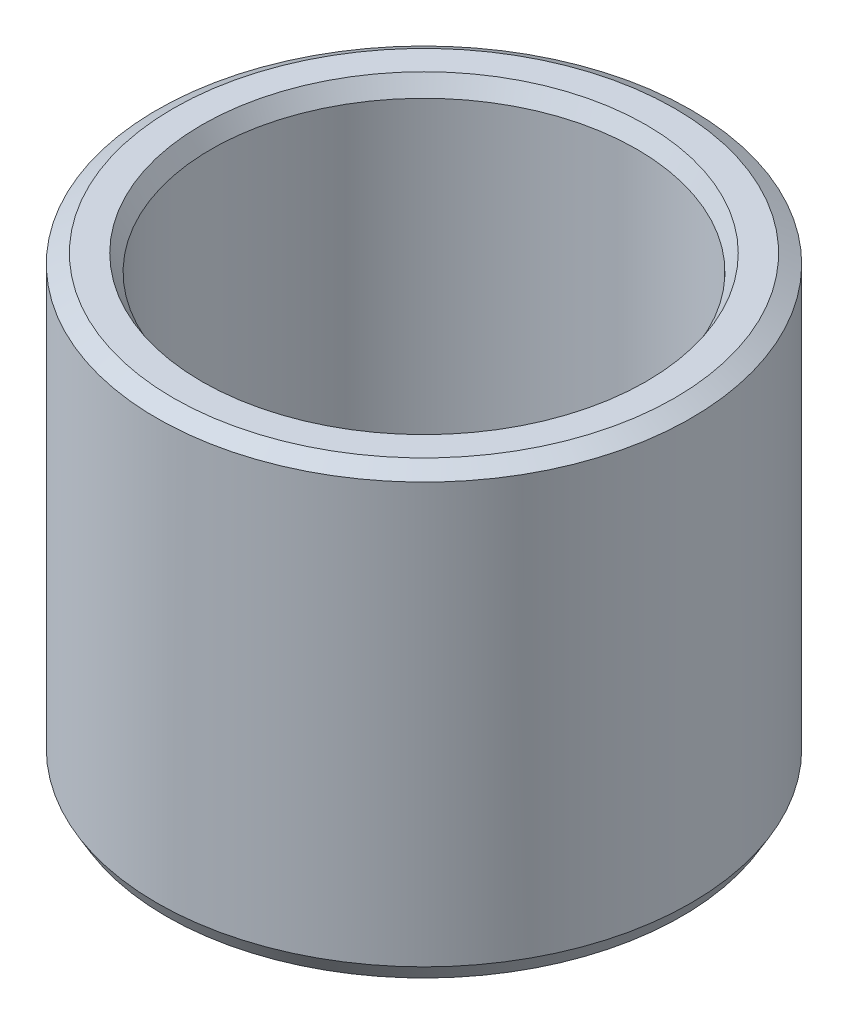
ISO-10303-21;
HEADER;
FILE_DESCRIPTION(('STEP AP214'),'2;1');
FILE_NAME('part.step','',(''),(''),'','','');
FILE_SCHEMA(('AUTOMOTIVE_DESIGN { 1 0 10303 214 1 1 1 1 }'));
ENDSEC;
DATA;
#1=APPLICATION_CONTEXT('core data for automotive mechanical design processes');
#2=APPLICATION_PROTOCOL_DEFINITION('international standard','automotive_design',2000,#1);
#3=PRODUCT_CONTEXT('',#1,'mechanical');
#4=PRODUCT('Part','Part','',(#3));
#5=PRODUCT_RELATED_PRODUCT_CATEGORY('part','',(#4));
#6=PRODUCT_DEFINITION_FORMATION('','',#4);
#7=PRODUCT_DEFINITION_CONTEXT('part definition',#1,'design');
#8=PRODUCT_DEFINITION('design','',#6,#7);
#9=PRODUCT_DEFINITION_SHAPE('','',#8);
#10=(LENGTH_UNIT() NAMED_UNIT(*) SI_UNIT(.MILLI.,.METRE.));
#11=(NAMED_UNIT(*) PLANE_ANGLE_UNIT() SI_UNIT($,.RADIAN.));
#12=(NAMED_UNIT(*) SI_UNIT($,.STERADIAN.) SOLID_ANGLE_UNIT());
#13=UNCERTAINTY_MEASURE_WITH_UNIT(LENGTH_MEASURE(1.E-05),#10,'distance_accuracy_value','');
#14=(GEOMETRIC_REPRESENTATION_CONTEXT(3) GLOBAL_UNCERTAINTY_ASSIGNED_CONTEXT((#13)) GLOBAL_UNIT_ASSIGNED_CONTEXT((#10,
#11,#12)) REPRESENTATION_CONTEXT('',''));
#15=CARTESIAN_POINT('',(0.,0.,0.));
#16=DIRECTION('',(0.,0.,1.));
#17=DIRECTION('',(1.,0.,0.));
#18=AXIS2_PLACEMENT_3D('',#15,#16,#17);
#19=CARTESIAN_POINT('',(0.,83.408632358048,0.));
#20=DIRECTION('',(0.,-1.,0.));
#21=DIRECTION('',(0.,0.,-1.));
#22=AXIS2_PLACEMENT_3D('',#19,#20,#21);
#23=CYLINDRICAL_SURFACE('',#22,50.);
#24=CARTESIAN_POINT('',(0.,3.05343406579016,0.));
#25=DIRECTION('',(0.,1.,0.));
#26=DIRECTION('',(0.,0.,1.));
#27=AXIS2_PLACEMENT_3D('',#24,#25,#26);
#28=CIRCLE('',#27,50.);
#29=CARTESIAN_POINT('',(0.,3.05343406579016,50.));
#30=VERTEX_POINT('',#29);
#31=EDGE_CURVE('E10',#30,#30,#28,.T.);
#32=ORIENTED_EDGE('',*,*,#31,.T.);
#33=EDGE_LOOP('',(#32));
#34=FACE_BOUND('',#33,.T.);
#35=CARTESIAN_POINT('',(0.,81.6457313782112,0.));
#36=DIRECTION('',(0.,1.,0.));
#37=DIRECTION('',(0.,0.,1.));
#38=AXIS2_PLACEMENT_3D('',#35,#36,#37);
#39=CIRCLE('',#38,50.);
#40=CARTESIAN_POINT('',(0.,81.6457313782112,-50.));
#41=VERTEX_POINT('',#40);
#42=EDGE_CURVE('E50',#41,#41,#39,.F.);
#43=ORIENTED_EDGE('',*,*,#42,.T.);
#44=EDGE_LOOP('',(#43));
#45=FACE_BOUND('',#44,.T.);
#46=ADVANCED_FACE('F39',(#34,#45),#23,.T.);
#47=CARTESIAN_POINT('',(0.,83.408632358048,0.));
#48=DIRECTION('',(0.,1.,0.));
#49=DIRECTION('',(0.,0.,1.));
#50=AXIS2_PLACEMENT_3D('',#47,#48,#49);
#51=PLANE('',#50);
#52=CARTESIAN_POINT('',(0.,83.408632358048,0.));
#53=DIRECTION('',(0.,1.,0.));
#54=DIRECTION('',(0.,0.,1.));
#55=AXIS2_PLACEMENT_3D('',#52,#53,#54);
#56=CIRCLE('',#55,41.603976259714);
#57=CARTESIAN_POINT('',(0.,83.408632358048,41.603976259714));
#58=VERTEX_POINT('',#57);
#59=EDGE_CURVE('E58',#58,#58,#56,.F.);
#60=ORIENTED_EDGE('',*,*,#59,.T.);
#61=EDGE_LOOP('',(#60));
#62=FACE_BOUND('',#61,.T.);
#63=CARTESIAN_POINT('',(0.,83.408632358048,0.));
#64=DIRECTION('',(0.,1.,0.));
#65=DIRECTION('',(0.,0.,1.));
#66=AXIS2_PLACEMENT_3D('',#63,#64,#65);
#67=CIRCLE('',#66,46.9465659342098);
#68=CARTESIAN_POINT('',(0.,83.408632358048,-46.9465659342098));
#69=VERTEX_POINT('',#68);
#70=EDGE_CURVE('E61',#69,#69,#67,.T.);
#71=ORIENTED_EDGE('',*,*,#70,.T.);
#72=EDGE_LOOP('',(#71));
#73=FACE_BOUND('',#72,.T.);
#74=ADVANCED_FACE('F88',(#62,#73),#51,.T.);
#75=CARTESIAN_POINT('',(0.,0.,0.));
#76=DIRECTION('',(0.,1.,0.));
#77=DIRECTION('',(0.,0.,1.));
#78=AXIS2_PLACEMENT_3D('',#75,#76,#77);
#79=PLANE('',#78);
#80=CARTESIAN_POINT('',(0.,0.,0.));
#81=DIRECTION('',(0.,1.,0.));
#82=DIRECTION('',(0.,0.,1.));
#83=AXIS2_PLACEMENT_3D('',#80,#81,#82);
#84=CIRCLE('',#83,42.8945093456675);
#85=CARTESIAN_POINT('',(0.,0.,-42.8945093456675));
#86=VERTEX_POINT('',#85);
#87=EDGE_CURVE('E51',#86,#86,#84,.T.);
#88=ORIENTED_EDGE('',*,*,#87,.T.);
#89=EDGE_LOOP('',(#88));
#90=FACE_BOUND('',#89,.T.);
#91=CARTESIAN_POINT('',(0.,0.,0.));
#92=DIRECTION('',(0.,1.,0.));
#93=DIRECTION('',(0.,0.,1.));
#94=AXIS2_PLACEMENT_3D('',#91,#92,#93);
#95=CIRCLE('',#94,48.2370990201633);
#96=CARTESIAN_POINT('',(0.,0.,48.2370990201633));
#97=VERTEX_POINT('',#96);
#98=EDGE_CURVE('E54',#97,#97,#95,.F.);
#99=ORIENTED_EDGE('',*,*,#98,.T.);
#100=EDGE_LOOP('',(#99));
#101=FACE_BOUND('',#100,.T.);
#102=ADVANCED_FACE('F83',(#90,#101),#79,.F.);
#103=CARTESIAN_POINT('',(0.,83.408632358048,0.));
#104=DIRECTION('',(0.,-1.,0.));
#105=DIRECTION('',(0.,0.,-1.));
#106=AXIS2_PLACEMENT_3D('',#103,#104,#105);
#107=CYLINDRICAL_SURFACE('',#106,39.8410752798773);
#108=CARTESIAN_POINT('',(0.,80.3551982922578,0.));
#109=DIRECTION('',(0.,1.,0.));
#110=DIRECTION('',(0.,0.,1.));
#111=AXIS2_PLACEMENT_3D('',#108,#109,#110);
#112=CIRCLE('',#111,39.8410752798773);
#113=CARTESIAN_POINT('',(0.,80.3551982922578,39.8410752798773));
#114=VERTEX_POINT('',#113);
#115=EDGE_CURVE('E67',#114,#114,#112,.T.);
#116=ORIENTED_EDGE('',*,*,#115,.T.);
#117=EDGE_LOOP('',(#116));
#118=FACE_BOUND('',#117,.T.);
#119=CARTESIAN_POINT('',(0.,1.76290097983677,0.));
#120=DIRECTION('',(0.,1.,0.));
#121=DIRECTION('',(0.,0.,1.));
#122=AXIS2_PLACEMENT_3D('',#119,#120,#121);
#123=CIRCLE('',#122,39.8410752798773);
#124=CARTESIAN_POINT('',(0.,1.76290097983676,-39.8410752798773));
#125=VERTEX_POINT('',#124);
#126=EDGE_CURVE('E69',#125,#125,#123,.F.);
#127=ORIENTED_EDGE('',*,*,#126,.T.);
#128=EDGE_LOOP('',(#127));
#129=FACE_BOUND('',#128,.T.);
#130=ADVANCED_FACE('F71',(#118,#129),#107,.F.);
#131=CARTESIAN_POINT('',(0.,80.3551982922578,0.));
#132=DIRECTION('',(0.,1.,0.));
#133=DIRECTION('',(0.,0.,1.));
#134=AXIS2_PLACEMENT_3D('',#131,#132,#133);
#135=CONICAL_SURFACE('',#134,39.8410752798773,0.523598775598302);
#136=ORIENTED_EDGE('',*,*,#59,.F.);
#137=EDGE_LOOP('',(#136));
#138=FACE_BOUND('',#137,.T.);
#139=ORIENTED_EDGE('',*,*,#115,.F.);
#140=EDGE_LOOP('',(#139));
#141=FACE_BOUND('',#140,.T.);
#142=ADVANCED_FACE('F77',(#138,#141),#135,.F.);
#143=CARTESIAN_POINT('',(0.,0.,0.));
#144=DIRECTION('',(0.,-1.,0.));
#145=DIRECTION('',(0.,0.,-1.));
#146=AXIS2_PLACEMENT_3D('',#143,#144,#145);
#147=CONICAL_SURFACE('',#146,42.8945093456675,1.04719755119659);
#148=CARTESIAN_POINT('',(0.,1.76290097983676,-39.8410752798773));
#149=CARTESIAN_POINT('',(0.,1.74453742796347,-39.8728818847293));
#150=CARTESIAN_POINT('',(0.,1.72617387609017,-39.9046884895812));
#151=CARTESIAN_POINT('',(0.,1.68944677234357,-39.9683016992852));
#152=CARTESIAN_POINT('',(0.,1.67108322047027,-40.0001083041372));
#153=CARTESIAN_POINT('',(0.,1.63435611672367,-40.0637215138411));
#154=CARTESIAN_POINT('',(0.,1.61599256485037,-40.0955281186931));
#155=CARTESIAN_POINT('',(0.,1.57926546110377,-40.1591413283971));
#156=CARTESIAN_POINT('',(0.,1.56090190923047,-40.1909479332491));
#157=CARTESIAN_POINT('',(0.,1.52417480548387,-40.254561142953));
#158=CARTESIAN_POINT('',(0.,1.50581125361057,-40.286367747805));
#159=CARTESIAN_POINT('',(0.,1.46908414986397,-40.349980957509));
#160=CARTESIAN_POINT('',(0.,1.45072059799067,-40.381787562361));
#161=CARTESIAN_POINT('',(0.,1.41399349424407,-40.4454007720649));
#162=CARTESIAN_POINT('',(0.,1.39562994237077,-40.4772073769169));
#163=CARTESIAN_POINT('',(0.,1.35890283862417,-40.5408205866209));
#164=CARTESIAN_POINT('',(0.,1.34053928675087,-40.5726271914728));
#165=CARTESIAN_POINT('',(0.,1.30381218300427,-40.6362404011768));
#166=CARTESIAN_POINT('',(0.,1.28544863113097,-40.6680470060288));
#167=CARTESIAN_POINT('',(0.,1.24872152738437,-40.7316602157327));
#168=CARTESIAN_POINT('',(0.,1.23035797551108,-40.7634668205847));
#169=CARTESIAN_POINT('',(0.,1.19363087176448,-40.8270800302887));
#170=CARTESIAN_POINT('',(0.,1.17526731989118,-40.8588866351407));
#171=CARTESIAN_POINT('',(0.,1.13854021614458,-40.9224998448446));
#172=CARTESIAN_POINT('',(0.,1.12017666427128,-40.9543064496966));
#173=CARTESIAN_POINT('',(0.,1.08344956052468,-41.0179196594006));
#174=CARTESIAN_POINT('',(0.,1.06508600865138,-41.0497262642526));
#175=CARTESIAN_POINT('',(0.,1.02835890490478,-41.1133394739565));
#176=CARTESIAN_POINT('',(0.,1.00999535303148,-41.1451460788085));
#177=CARTESIAN_POINT('',(0.,0.973268249284881,-41.2087592885125));
#178=CARTESIAN_POINT('',(0.,0.954904697411581,-41.2405658933644));
#179=CARTESIAN_POINT('',(0.,0.918177593664982,-41.3041791030684));
#180=CARTESIAN_POINT('',(0.,0.899814041791681,-41.3359857079204));
#181=CARTESIAN_POINT('',(0.,0.863086938045083,-41.3995989176244));
#182=CARTESIAN_POINT('',(0.,0.844723386171783,-41.4314055224763));
#183=CARTESIAN_POINT('',(0.,0.807996282425185,-41.4950187321803));
#184=CARTESIAN_POINT('',(0.,0.789632730551884,-41.5268253370323));
#185=CARTESIAN_POINT('',(0.,0.752905626805285,-41.5904385467362));
#186=CARTESIAN_POINT('',(0.,0.734542074931985,-41.6222451515882));
#187=CARTESIAN_POINT('',(0.,0.697814971185386,-41.6858583612922));
#188=CARTESIAN_POINT('',(0.,0.679451419312086,-41.7176649661442));
#189=CARTESIAN_POINT('',(0.,0.642724315565487,-41.7812781758481));
#190=CARTESIAN_POINT('',(0.,0.624360763692188,-41.8130847807001));
#191=CARTESIAN_POINT('',(0.,0.587633659945588,-41.8766979904041));
#192=CARTESIAN_POINT('',(0.,0.569270108072288,-41.9085045952561));
#193=CARTESIAN_POINT('',(0.,0.532543004325689,-41.97211780496));
#194=CARTESIAN_POINT('',(0.,0.51417945245239,-42.003924409812));
#195=CARTESIAN_POINT('',(0.,0.477452348705791,-42.067537619516));
#196=CARTESIAN_POINT('',(0.,0.459088796832491,-42.0993442243679));
#197=CARTESIAN_POINT('',(0.,0.422361693085891,-42.1629574340719));
#198=CARTESIAN_POINT('',(0.,0.403998141212592,-42.1947640389239));
#199=CARTESIAN_POINT('',(0.,0.367271037465993,-42.2583772486279));
#200=CARTESIAN_POINT('',(0.,0.348907485592693,-42.2901838534798));
#201=CARTESIAN_POINT('',(0.,0.312180381846094,-42.3537970631838));
#202=CARTESIAN_POINT('',(0.,0.293816829972794,-42.3856036680358));
#203=CARTESIAN_POINT('',(0.,0.257089726226195,-42.4492168777397));
#204=CARTESIAN_POINT('',(0.,0.238726174352895,-42.4810234825917));
#205=CARTESIAN_POINT('',(0.,0.201999070606296,-42.5446366922957));
#206=CARTESIAN_POINT('',(0.,0.183635518732997,-42.5764432971477));
#207=CARTESIAN_POINT('',(0.,0.146908414986398,-42.6400565068516));
#208=CARTESIAN_POINT('',(0.,0.128544863113098,-42.6718631117036));
#209=CARTESIAN_POINT('',(0.,0.091817759366498,-42.7354763214076));
#210=CARTESIAN_POINT('',(0.,0.0734542074931984,-42.7672829262596));
#211=CARTESIAN_POINT('',(0.,0.0367271037465994,-42.8308961359635));
#212=CARTESIAN_POINT('',(0.,0.0183635518732998,-42.8627027408155));
#213=CARTESIAN_POINT('',(0.,0.,-42.8945093456675));
#214=B_SPLINE_CURVE_WITH_KNOTS('',3,(#148,#149,#150,#151,#152,#153,#154,#155,#156,#157,#158,
#159,#160,#161,#162,#163,#164,#165,#166,#167,#168,#169,#170,#171,#172,#173,#174,#175,#176,#177,
#178,#179,#180,#181,#182,#183,#184,#185,#186,#187,#188,#189,#190,#191,#192,#193,#194,#195,#196,
#197,#198,#199,#200,#201,#202,#203,#204,#205,#206,#207,#208,#209,#210,#211,#212,#213),
.UNSPECIFIED.,.F.,.F.,(4,2,2,2,2,2,2,2,2,2,2,2,2,2,2,2,2,2,2,2,2,2,2,2,2,2,2,2,2,2,2,2,4),(0.,
0.110181311239796,0.220362622479592,0.330543933719388,0.440725244959191,0.550906556198987,
0.661087867438783,0.771269178678579,0.881450489918375,0.991631801158172,1.10181311239797,
1.21199442363777,1.32217573487757,1.43235704611736,1.54253835735716,1.65271966859695,
1.76290097983675,1.87308229107655,1.98326360231635,2.09344491355614,2.20362622479594,
2.31380753603574,2.42398884727553,2.53417015851534,2.64435146975513,2.75453278099493,
2.86471409223472,2.97489540347452,3.08507671471432,3.19525802595412,3.30543933719391,
3.41562064843371,3.52580195967351),.UNSPECIFIED.);
#215=EDGE_CURVE('BSEAM73',#125,#86,#214,.T.);
#216=ORIENTED_EDGE('',*,*,#126,.F.);
#217=ORIENTED_EDGE('',*,*,#87,.F.);
#218=ORIENTED_EDGE('',*,*,#215,.T.);
#219=ORIENTED_EDGE('',*,*,#215,.F.);
#220=EDGE_LOOP('',(#216,#218,#217,#219));
#221=FACE_BOUND('',#220,.T.);
#222=ADVANCED_FACE('F73',(#221),#147,.F.);
#223=CARTESIAN_POINT('',(0.,3.05343406579016,0.));
#224=DIRECTION('',(0.,1.,0.));
#225=DIRECTION('',(0.,0.,1.));
#226=AXIS2_PLACEMENT_3D('',#223,#224,#225);
#227=CONICAL_SURFACE('',#226,50.,0.523598775598301);
#228=ORIENTED_EDGE('',*,*,#98,.F.);
#229=EDGE_LOOP('',(#228));
#230=FACE_BOUND('',#229,.T.);
#231=ORIENTED_EDGE('',*,*,#31,.F.);
#232=EDGE_LOOP('',(#231));
#233=FACE_BOUND('',#232,.T.);
#234=ADVANCED_FACE('F76',(#230,#233),#227,.T.);
#235=CARTESIAN_POINT('',(0.,83.408632358048,0.));
#236=DIRECTION('',(0.,-1.,0.));
#237=DIRECTION('',(0.,0.,-1.));
#238=AXIS2_PLACEMENT_3D('',#235,#236,#237);
#239=CONICAL_SURFACE('',#238,46.9465659342098,1.04719755119659);
#240=CARTESIAN_POINT('',(0.,81.6457313782112,-50.));
#241=CARTESIAN_POINT('',(0.,81.6640949300845,-49.968193395148));
#242=CARTESIAN_POINT('',(0.,81.6824584819578,-49.9363867902961));
#243=CARTESIAN_POINT('',(0.,81.7191855857044,-49.8727735805921));
#244=CARTESIAN_POINT('',(0.,81.7375491375777,-49.8409669757401));
#245=CARTESIAN_POINT('',(0.,81.7742762413243,-49.7773537660361));
#246=CARTESIAN_POINT('',(0.,81.7926397931976,-49.7455471611842));
#247=CARTESIAN_POINT('',(0.,81.8293668969442,-49.6819339514802));
#248=CARTESIAN_POINT('',(0.,81.8477304488175,-49.6501273466282));
#249=CARTESIAN_POINT('',(0.,81.8844575525641,-49.5865141369243));
#250=CARTESIAN_POINT('',(0.,81.9028211044374,-49.5547075320723));
#251=CARTESIAN_POINT('',(0.,81.939548208184,-49.4910943223683));
#252=CARTESIAN_POINT('',(0.,81.9579117600573,-49.4592877175163));
#253=CARTESIAN_POINT('',(0.,81.9946388638039,-49.3956745078124));
#254=CARTESIAN_POINT('',(0.,82.0130024156772,-49.3638679029604));
#255=CARTESIAN_POINT('',(0.,82.0497295194238,-49.3002546932564));
#256=CARTESIAN_POINT('',(0.,82.0680930712971,-49.2684480884044));
#257=CARTESIAN_POINT('',(0.,82.1048201750437,-49.2048348787005));
#258=CARTESIAN_POINT('',(0.,82.123183726917,-49.1730282738485));
#259=CARTESIAN_POINT('',(0.,82.1599108306636,-49.1094150641445));
#260=CARTESIAN_POINT('',(0.,82.1782743825369,-49.0776084592926));
#261=CARTESIAN_POINT('',(0.,82.2150014862835,-49.0139952495886));
#262=CARTESIAN_POINT('',(0.,82.2333650381568,-48.9821886447366));
#263=CARTESIAN_POINT('',(0.,82.2700921419034,-48.9185754350327));
#264=CARTESIAN_POINT('',(0.,82.2884556937767,-48.8867688301807));
#265=CARTESIAN_POINT('',(0.,82.3251827975233,-48.8231556204767));
#266=CARTESIAN_POINT('',(0.,82.3435463493966,-48.7913490156247));
#267=CARTESIAN_POINT('',(0.,82.3802734531432,-48.7277358059208));
#268=CARTESIAN_POINT('',(0.,82.3986370050165,-48.6959292010688));
#269=CARTESIAN_POINT('',(0.,82.4353641087631,-48.6323159913648));
#270=CARTESIAN_POINT('',(0.,82.4537276606364,-48.6005093865128));
#271=CARTESIAN_POINT('',(0.,82.490454764383,-48.5368961768089));
#272=CARTESIAN_POINT('',(0.,82.5088183162563,-48.5050895719569));
#273=CARTESIAN_POINT('',(0.,82.5455454200029,-48.4414763622529));
#274=CARTESIAN_POINT('',(0.,82.5639089718762,-48.4096697574009));
#275=CARTESIAN_POINT('',(0.,82.6006360756228,-48.346056547697));
#276=CARTESIAN_POINT('',(0.,82.6189996274961,-48.314249942845));
#277=CARTESIAN_POINT('',(0.,82.6557267312427,-48.250636733141));
#278=CARTESIAN_POINT('',(0.,82.674090283116,-48.2188301282891));
#279=CARTESIAN_POINT('',(0.,82.7108173868626,-48.1552169185851));
#280=CARTESIAN_POINT('',(0.,82.7291809387359,-48.1234103137331));
#281=CARTESIAN_POINT('',(0.,82.7659080424825,-48.0597971040292));
#282=CARTESIAN_POINT('',(0.,82.7842715943558,-48.0279904991772));
#283=CARTESIAN_POINT('',(0.,82.8209986981024,-47.9643772894732));
#284=CARTESIAN_POINT('',(0.,82.8393622499757,-47.9325706846212));
#285=CARTESIAN_POINT('',(0.,82.8760893537223,-47.8689574749173));
#286=CARTESIAN_POINT('',(0.,82.8944529055956,-47.8371508700653));
#287=CARTESIAN_POINT('',(0.,82.9311800093422,-47.7735376603613));
#288=CARTESIAN_POINT('',(0.,82.9495435612154,-47.7417310555093));
#289=CARTESIAN_POINT('',(0.,82.9862706649621,-47.6781178458054));
#290=CARTESIAN_POINT('',(0.,83.0046342168353,-47.6463112409534));
#291=CARTESIAN_POINT('',(0.,83.041361320582,-47.5826980312494));
#292=CARTESIAN_POINT('',(0.,83.0597248724552,-47.5508914263974));
#293=CARTESIAN_POINT('',(0.,83.0964519762019,-47.4872782166935));
#294=CARTESIAN_POINT('',(0.,83.1148155280751,-47.4554716118415));
#295=CARTESIAN_POINT('',(0.,83.1515426318218,-47.3918584021375));
#296=CARTESIAN_POINT('',(0.,83.169906183695,-47.3600517972856));
#297=CARTESIAN_POINT('',(0.,83.2066332874417,-47.2964385875816));
#298=CARTESIAN_POINT('',(0.,83.2249968393149,-47.2646319827296));
#299=CARTESIAN_POINT('',(0.,83.2617239430616,-47.2010187730256));
#300=CARTESIAN_POINT('',(0.,83.2800874949348,-47.1692121681737));
#301=CARTESIAN_POINT('',(0.,83.3168145986815,-47.1055989584697));
#302=CARTESIAN_POINT('',(0.,83.3351781505547,-47.0737923536177));
#303=CARTESIAN_POINT('',(0.,83.3719052543014,-47.0101791439138));
#304=CARTESIAN_POINT('',(0.,83.3902688061746,-46.9783725390618));
#305=CARTESIAN_POINT('',(0.,83.408632358048,-46.9465659342098));
#306=B_SPLINE_CURVE_WITH_KNOTS('',3,(#240,#241,#242,#243,#244,#245,#246,#247,#248,#249,#250,
#251,#252,#253,#254,#255,#256,#257,#258,#259,#260,#261,#262,#263,#264,#265,#266,#267,#268,#269,
#270,#271,#272,#273,#274,#275,#276,#277,#278,#279,#280,#281,#282,#283,#284,#285,#286,#287,#288,
#289,#290,#291,#292,#293,#294,#295,#296,#297,#298,#299,#300,#301,#302,#303,#304,#305),
.UNSPECIFIED.,.F.,.F.,(4,2,2,2,2,2,2,2,2,2,2,2,2,2,2,2,2,2,2,2,2,2,2,2,2,2,2,2,2,2,2,2,4),(0.,
0.110181311239796,0.220362622479599,0.330543933719395,0.440725244959191,0.550906556198988,
0.661087867438784,0.771269178678581,0.881450489918383,0.99163180115818,1.10181311239798,
1.21199442363777,1.32217573487757,1.43235704611737,1.54253835735717,1.65271966859696,
1.76290097983676,1.87308229107656,1.98326360231636,2.09344491355616,2.20362622479595,
2.31380753603575,2.42398884727554,2.53417015851535,2.64435146975514,2.75453278099494,
2.86471409223474,2.97489540347453,3.08507671471434,3.19525802595413,3.30543933719393,
3.41562064843373,3.52580195967352),.UNSPECIFIED.);
#307=EDGE_CURVE('BSEAM45',#41,#69,#306,.T.);
#308=ORIENTED_EDGE('',*,*,#42,.F.);
#309=ORIENTED_EDGE('',*,*,#70,.F.);
#310=ORIENTED_EDGE('',*,*,#307,.T.);
#311=ORIENTED_EDGE('',*,*,#307,.F.);
#312=EDGE_LOOP('',(#308,#310,#309,#311));
#313=FACE_BOUND('',#312,.T.);
#314=ADVANCED_FACE('F45',(#313),#239,.T.);
#315=CLOSED_SHELL('',(#46,#74,#102,#130,#142,#222,#234,#314));
#316=MANIFOLD_SOLID_BREP('B2',#315);
#317=ADVANCED_BREP_SHAPE_REPRESENTATION('',(#18,#316),#14);
#318=SHAPE_DEFINITION_REPRESENTATION(#9,#317);
ENDSEC;
END-ISO-10303-21;
